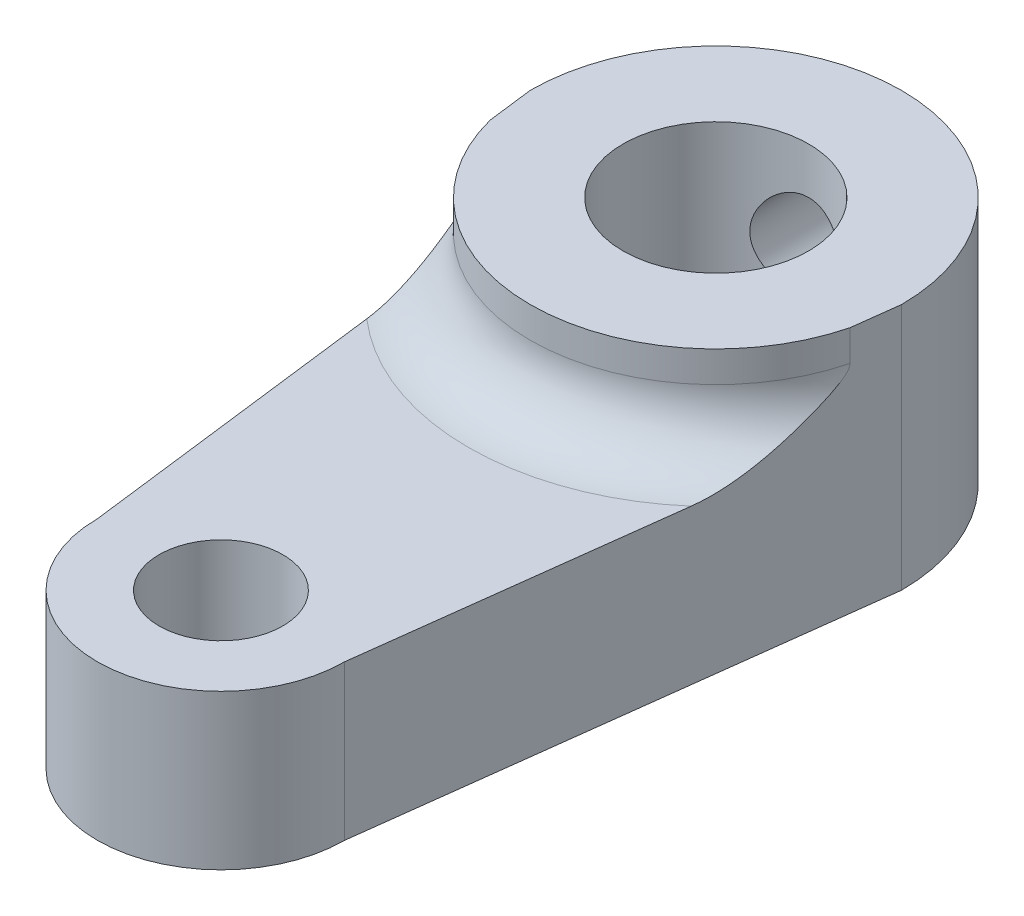
ISO-10303-21;
HEADER;
FILE_DESCRIPTION(('STEP AP214'),'2;1');
FILE_NAME('part.step','',(''),(''),'','','');
FILE_SCHEMA(('AUTOMOTIVE_DESIGN { 1 0 10303 214 1 1 1 1 }'));
ENDSEC;
DATA;
#1=APPLICATION_CONTEXT('core data for automotive mechanical design processes');
#2=APPLICATION_PROTOCOL_DEFINITION('international standard','automotive_design',2000,#1);
#3=PRODUCT_CONTEXT('',#1,'mechanical');
#4=PRODUCT('Part','Part','',(#3));
#5=PRODUCT_RELATED_PRODUCT_CATEGORY('part','',(#4));
#6=PRODUCT_DEFINITION_FORMATION('','',#4);
#7=PRODUCT_DEFINITION_CONTEXT('part definition',#1,'design');
#8=PRODUCT_DEFINITION('design','',#6,#7);
#9=PRODUCT_DEFINITION_SHAPE('','',#8);
#10=(LENGTH_UNIT() NAMED_UNIT(*) SI_UNIT(.MILLI.,.METRE.));
#11=(NAMED_UNIT(*) PLANE_ANGLE_UNIT() SI_UNIT($,.RADIAN.));
#12=(NAMED_UNIT(*) SI_UNIT($,.STERADIAN.) SOLID_ANGLE_UNIT());
#13=UNCERTAINTY_MEASURE_WITH_UNIT(LENGTH_MEASURE(1.E-05),#10,'distance_accuracy_value','');
#14=(GEOMETRIC_REPRESENTATION_CONTEXT(3) GLOBAL_UNCERTAINTY_ASSIGNED_CONTEXT((#13)) GLOBAL_UNIT_ASSIGNED_CONTEXT((#10,
#11,#12)) REPRESENTATION_CONTEXT('',''));
#15=CARTESIAN_POINT('',(0.,0.,0.));
#16=DIRECTION('',(0.,0.,1.));
#17=DIRECTION('',(1.,0.,0.));
#18=AXIS2_PLACEMENT_3D('',#15,#16,#17);
#19=CARTESIAN_POINT('',(5.90769230769231,8.,0.738461538461538));
#20=DIRECTION('',(0.992277876713668,0.,0.124034734589208));
#21=DIRECTION('',(0.124034734589208,0.,-0.992277876713668));
#22=AXIS2_PLACEMENT_3D('',#19,#20,#21);
#23=PLANE('',#22);
#24=DIRECTION('',(-0.124034734589208,0.,0.992277876713668));
#25=VECTOR('',#24,1.);
#26=CARTESIAN_POINT('',(5.90769230769231,0.,0.738461538461538));
#27=LINE('',#26,#25);
#28=CARTESIAN_POINT('',(6.,0.,0.));
#29=VERTEX_POINT('',#28);
#30=CARTESIAN_POINT('',(4.,0.,16.));
#31=VERTEX_POINT('',#30);
#32=EDGE_CURVE('E192',#29,#31,#27,.T.);
#33=ORIENTED_EDGE('',*,*,#32,.F.);
#34=DIRECTION('',(0.,-1.,0.));
#35=VECTOR('',#34,1.);
#36=CARTESIAN_POINT('',(6.,8.,0.));
#37=LINE('',#36,#35);
#38=CARTESIAN_POINT('',(6.,8.,0.));
#39=VERTEX_POINT('',#38);
#40=EDGE_CURVE('E222',#39,#29,#37,.T.);
#41=ORIENTED_EDGE('',*,*,#40,.F.);
#42=DIRECTION('',(-0.124034734589208,0.,0.992277876713668));
#43=VECTOR('',#42,1.);
#44=CARTESIAN_POINT('',(5.90769230769231,8.,0.738461538461538));
#45=LINE('',#44,#43);
#46=CARTESIAN_POINT('',(5.81538461538461,8.,1.47692307692309));
#47=VERTEX_POINT('',#46);
#48=EDGE_CURVE('E200',#39,#47,#45,.T.);
#49=ORIENTED_EDGE('',*,*,#48,.T.);
#50=DIRECTION('',(0.,-1.,0.));
#51=VECTOR('',#50,1.);
#52=CARTESIAN_POINT('',(5.81538461538461,8.,1.47692307692309));
#53=LINE('',#52,#51);
#54=CARTESIAN_POINT('',(5.81538461538461,7.,1.47692307692309));
#55=VERTEX_POINT('',#54);
#56=EDGE_CURVE('E215',#47,#55,#53,.T.);
#57=ORIENTED_EDGE('',*,*,#56,.T.);
#58=CARTESIAN_POINT('',(5.81538461538461,7.,1.47692307692309));
#59=CARTESIAN_POINT('',(5.81539476640519,6.98206835129727,1.47684186875847));
#60=CARTESIAN_POINT('',(5.81514366955309,6.96428540709011,1.47885064357526));
#61=CARTESIAN_POINT('',(5.81422921444883,6.92983220472927,1.48616628440938));
#62=CARTESIAN_POINT('',(5.81357557943099,6.91314568778468,1.49139536455203));
#63=CARTESIAN_POINT('',(5.81162595293372,6.87420948872529,1.50699237653024));
#64=CARTESIAN_POINT('',(5.81017650306979,6.85248149719556,1.51858797544166));
#65=CARTESIAN_POINT('',(5.80689217108803,6.81076560975714,1.54486263129576));
#66=CARTESIAN_POINT('',(5.80505296806003,6.79080110981863,1.55957625551977));
#67=CARTESIAN_POINT('',(5.7991545539981,6.73272152069167,1.60676356801519));
#68=CARTESIAN_POINT('',(5.7947497941713,6.69694269160291,1.64200164662958));
#69=CARTESIAN_POINT('',(5.78554512520158,6.62879824358649,1.71563899838738));
#70=CARTESIAN_POINT('',(5.78074363117118,6.59644762198184,1.75405095063054));
#71=CARTESIAN_POINT('',(5.77088827444036,6.53373910686026,1.83289380447712));
#72=CARTESIAN_POINT('',(5.76583285435553,6.5033970939871,1.87333716515574));
#73=CARTESIAN_POINT('',(5.75559700824011,6.44433146970121,1.9552239340791));
#74=CARTESIAN_POINT('',(5.75041686682505,6.41560459540483,1.99666506539963));
#75=CARTESIAN_POINT('',(5.73484220295515,6.33170775155011,2.12126237635882));
#76=CARTESIAN_POINT('',(5.72431018815304,6.27819828583969,2.20551849477567));
#77=CARTESIAN_POINT('',(5.70301501839821,6.17423919749159,2.37587985281428));
#78=CARTESIAN_POINT('',(5.69225178892419,6.12379058203655,2.46198568860647));
#79=CARTESIAN_POINT('',(5.67052305321617,6.02544013060181,2.63581557427062));
#80=CARTESIAN_POINT('',(5.65955722874636,5.97754285995481,2.72354217002912));
#81=CARTESIAN_POINT('',(5.63746380566257,5.88428321543631,2.9002895546994));
#82=CARTESIAN_POINT('',(5.62633623164352,5.83892046115491,2.98931014685185));
#83=CARTESIAN_POINT('',(5.59291980054501,5.70748650409316,3.25664159563991));
#84=CARTESIAN_POINT('',(5.57040018808343,5.62517964425519,3.43679849533257));
#85=CARTESIAN_POINT('',(5.52477249391602,5.47230141460988,3.80182004867185));
#86=CARTESIAN_POINT('',(5.5016649031749,5.40172060179224,3.98668077460082));
#87=CARTESIAN_POINT('',(5.45956735311022,5.28746693256519,4.32346117511823));
#88=CARTESIAN_POINT('',(5.4406847693354,5.24123752816757,4.47452184531682));
#89=CARTESIAN_POINT('',(5.40257489846932,5.15935265505968,4.77940081224546));
#90=CARTESIAN_POINT('',(5.38334776102864,5.12369270834051,4.9332179117709));
#91=CARTESIAN_POINT('',(5.3443701465846,5.06438903547159,5.24503882732318));
#92=CARTESIAN_POINT('',(5.32461618800929,5.04088917160202,5.40307049592571));
#93=CARTESIAN_POINT('',(5.29482842693842,5.01674380568157,5.64137258449261));
#94=CARTESIAN_POINT('',(5.28486188080753,5.01054539863813,5.72110495353973));
#95=CARTESIAN_POINT('',(5.26489886909373,5.00217436340395,5.88080904725014));
#96=CARTESIAN_POINT('',(5.25490239259256,5.00000344779633,5.96078085925952));
#97=CARTESIAN_POINT('',(5.24490279296806,5.,6.04077765625551));
#98=B_SPLINE_CURVE_WITH_KNOTS('',3,(#58,#59,#60,#61,#62,#63,#64,#65,#66,#67,#68,#69,#70,#71,#72,
#73,#74,#75,#76,#77,#78,#79,#80,#81,#82,#83,#84,#85,#86,#87,#88,#89,#90,#91,#92,#93,#94,#95,#96,
#97),.UNSPECIFIED.,.F.,.F.,(4,2,2,2,2,2,2,2,2,2,2,2,2,2,2,2,2,2,2,4),(0.,0.0534457094729938,
0.105648500704282,0.179238899339844,0.253692350821764,0.404347373934459,0.555636393518103,
0.708005822765175,0.860055475605026,1.16103965292558,1.46212233884608,1.76372682895045,
2.06528592843856,2.66294892892358,3.26012827234663,3.73710737769687,4.21388410938346,
4.69617941237984,4.93786444212931,5.17965221844567),.UNSPECIFIED.);
#99=CARTESIAN_POINT('',(5.24490279296806,5.,6.04077765625551));
#100=VERTEX_POINT('',#99);
#101=EDGE_CURVE('E119',#55,#100,#98,.T.);
#102=ORIENTED_EDGE('',*,*,#101,.T.);
#103=DIRECTION('',(-0.124034734589208,0.,0.992277876713668));
#104=VECTOR('',#103,1.);
#105=CARTESIAN_POINT('',(5.90769230769231,5.,0.738461538461538));
#106=LINE('',#105,#104);
#107=CARTESIAN_POINT('',(4.,5.,16.));
#108=VERTEX_POINT('',#107);
#109=EDGE_CURVE('E183',#100,#108,#106,.T.);
#110=ORIENTED_EDGE('',*,*,#109,.T.);
#111=DIRECTION('',(0.,-1.,0.));
#112=VECTOR('',#111,1.);
#113=CARTESIAN_POINT('',(4.,5.,16.));
#114=LINE('',#113,#112);
#115=EDGE_CURVE('E182',#108,#31,#114,.T.);
#116=ORIENTED_EDGE('',*,*,#115,.T.);
#117=EDGE_LOOP('',(#33,#41,#49,#57,#102,#110,#116));
#118=FACE_BOUND('',#117,.T.);
#119=ADVANCED_FACE('F105',(#118),#23,.T.);
#120=CARTESIAN_POINT('',(0.,8.,0.));
#121=DIRECTION('',(0.,-1.,0.));
#122=DIRECTION('',(0.,0.,-1.));
#123=AXIS2_PLACEMENT_3D('',#120,#121,#122);
#124=CYLINDRICAL_SURFACE('',#123,6.);
#125=CARTESIAN_POINT('',(-1.5,5.,-5.80947501931113));
#126=CARTESIAN_POINT('',(-1.49999764715506,4.91716954944523,-5.80947660051185));
#127=CARTESIAN_POINT('',(-1.49311574729838,4.8343130607932,-5.81126583608348));
#128=CARTESIAN_POINT('',(-1.46581387527848,4.67097945309558,-5.81821117195949));
#129=CARTESIAN_POINT('',(-1.44538602404532,4.590503747319,-5.82336923173088));
#130=CARTESIAN_POINT('',(-1.39169471977917,4.43431787708778,-5.8364323475758));
#131=CARTESIAN_POINT('',(-1.35844783671268,4.3586017067686,-5.84433385614245));
#132=CARTESIAN_POINT('',(-1.28011268475684,4.21381348847605,-5.86198915217285));
#133=CARTESIAN_POINT('',(-1.23502391313641,4.14474172275187,-5.87174301827101));
#134=CARTESIAN_POINT('',(-1.13322505638712,4.01368301284268,-5.89224429813367));
#135=CARTESIAN_POINT('',(-1.07630213262243,3.95186383978997,-5.90300758573818));
#136=CARTESIAN_POINT('',(-0.952909238460398,3.8385431633838,-5.92417725309179));
#137=CARTESIAN_POINT('',(-0.886438376508183,3.78704262462695,-5.93458359939834));
#138=CARTESIAN_POINT('',(-0.744687120647372,3.69513471942124,-5.95404249312349));
#139=CARTESIAN_POINT('',(-0.669296745717072,3.65489216710312,-5.96307412440355));
#140=CARTESIAN_POINT('',(-0.512557910575657,3.58771421350815,-5.97858487155591));
#141=CARTESIAN_POINT('',(-0.431210331475164,3.56077684885069,-5.98506436400607));
#142=CARTESIAN_POINT('',(-0.266615255252497,3.52151129925285,-5.99462855308908));
#143=CARTESIAN_POINT('',(-0.183439631729385,3.50889821340405,-5.99777936306589));
#144=CARTESIAN_POINT('',(-0.0160972915576619,3.49774497243467,-6.00056156464379));
#145=CARTESIAN_POINT('',(0.0680692767228407,3.49920273667424,-6.00019347658022));
#146=CARTESIAN_POINT('',(0.23302837075858,3.51594491015009,-5.99602856972121));
#147=CARTESIAN_POINT('',(0.3138543234016,3.53092179503232,-5.99230801404524));
#148=CARTESIAN_POINT('',(0.471807371120528,3.5737827620291,-5.98194501914912));
#149=CARTESIAN_POINT('',(0.548934269055656,3.60166753122645,-5.97530242439065));
#150=CARTESIAN_POINT('',(0.698110055252709,3.66980154241224,-5.95972505820537));
#151=CARTESIAN_POINT('',(0.770106764649755,3.71016022679705,-5.95077011817032));
#152=CARTESIAN_POINT('',(0.906413433510732,3.80201340746976,-5.9315394228579));
#153=CARTESIAN_POINT('',(0.970722052628257,3.85350984113637,-5.92126343791494));
#154=CARTESIAN_POINT('',(1.09166105262743,3.96782524518943,-5.90018228261712));
#155=CARTESIAN_POINT('',(1.1480365186128,4.03091293540867,-5.88937031715551));
#156=CARTESIAN_POINT('',(1.24946456394453,4.16575998412415,-5.86869026110024));
#157=CARTESIAN_POINT('',(1.29451661406902,4.2375197476946,-5.85882221463582));
#158=CARTESIAN_POINT('',(1.3721821935339,4.38817402048938,-5.84112298098989));
#159=CARTESIAN_POINT('',(1.40473435045573,4.46710143818792,-5.83330190235433));
#160=CARTESIAN_POINT('',(1.45602843095451,4.62955128084587,-5.82071184083974));
#161=CARTESIAN_POINT('',(1.47477330982936,4.71307271838988,-5.81594220486131));
#162=CARTESIAN_POINT('',(1.4974977831991,4.87997570091387,-5.81013213623485));
#163=CARTESIAN_POINT('',(1.50185428435178,4.96330267599778,-5.80899653456189));
#164=CARTESIAN_POINT('',(1.49671019430933,5.1294931619469,-5.81032406088624));
#165=CARTESIAN_POINT('',(1.48721087870928,5.21235671477074,-5.8127868576076));
#166=CARTESIAN_POINT('',(1.4549552783626,5.37386855897282,-5.82094249172736));
#167=CARTESIAN_POINT('',(1.43241844096905,5.45256363594251,-5.82658182140625));
#168=CARTESIAN_POINT('',(1.37497084900237,5.60505887471101,-5.84040430962577));
#169=CARTESIAN_POINT('',(1.34005862862753,5.6788584554332,-5.84858776949168));
#170=CARTESIAN_POINT('',(1.25806240076193,5.82106476672041,-5.86677682255958));
#171=CARTESIAN_POINT('',(1.21075305230138,5.88933730402586,-5.87681501163985));
#172=CARTESIAN_POINT('',(1.10559043940168,6.01711301768081,-5.8975024984303));
#173=CARTESIAN_POINT('',(1.04773544220816,6.07661474999004,-5.90815189637082));
#174=CARTESIAN_POINT('',(0.921394081477087,6.18668662554257,-5.92918441818964));
#175=CARTESIAN_POINT('',(0.852677928797387,6.23699603752929,-5.93955421237102));
#176=CARTESIAN_POINT('',(0.707554024042012,6.32536152017074,-5.95858329968241));
#177=CARTESIAN_POINT('',(0.631146673436386,6.36341822996492,-5.96724268202376));
#178=CARTESIAN_POINT('',(0.473337302596634,6.42586762071676,-5.98182069442989));
#179=CARTESIAN_POINT('',(0.391976071541821,6.45035857062744,-5.98775898013446));
#180=CARTESIAN_POINT('',(0.226124640478211,6.48527620076505,-5.99631176037473));
#181=CARTESIAN_POINT('',(0.141635047561865,6.49570559524343,-5.99892689636045));
#182=CARTESIAN_POINT('',(-0.0256252896649893,6.5020513843633,-6.00051254113217));
#183=CARTESIAN_POINT('',(-0.108380740449049,6.49835256364308,-5.99957968320012));
#184=CARTESIAN_POINT('',(-0.272051244622109,6.4774282590585,-5.99438844686135));
#185=CARTESIAN_POINT('',(-0.352966352671329,6.46020317748035,-5.99013016735643));
#186=CARTESIAN_POINT('',(-0.510256553467224,6.41292167034361,-5.97878149280944));
#187=CARTESIAN_POINT('',(-0.586653741871528,6.38293482002806,-5.97170646753999));
#188=CARTESIAN_POINT('',(-0.733375579562202,6.31104413147101,-5.95546933370076));
#189=CARTESIAN_POINT('',(-0.803699461897576,6.26913879099565,-5.94630696206604));
#190=CARTESIAN_POINT('',(-0.938102892635848,6.17342714900439,-5.92660874521999));
#191=CARTESIAN_POINT('',(-1.00199248245087,6.11935978563893,-5.91604525418417));
#192=CARTESIAN_POINT('',(-1.11992253040688,6.0013657220393,-5.89485973579863));
#193=CARTESIAN_POINT('',(-1.17396048760228,5.93743652585314,-5.88423769428834));
#194=CARTESIAN_POINT('',(-1.27164303971884,5.800097878698,-5.86391213790822));
#195=CARTESIAN_POINT('',(-1.31507492916982,5.72653381488106,-5.85422945594827));
#196=CARTESIAN_POINT('',(-1.3888903449235,5.57291676511595,-5.83715933325924));
#197=CARTESIAN_POINT('',(-1.41928336463958,5.49286855083989,-5.82977022370054));
#198=CARTESIAN_POINT('',(-1.46163379284816,5.34413448225992,-5.81927863109675));
#199=CARTESIAN_POINT('',(-1.47598975589307,5.27616025342421,-5.8156299450082));
#200=CARTESIAN_POINT('',(-1.4951734388599,5.13879669650006,-5.81072757878358));
#201=CARTESIAN_POINT('',(-1.50000197155828,5.06940748963241,-5.80947369434945));
#202=CARTESIAN_POINT('',(-1.5,5.,-5.80947501931113));
#203=B_SPLINE_CURVE_WITH_KNOTS('',3,(#125,#126,#127,#128,#129,#130,#131,#132,#133,#134,#135,
#136,#137,#138,#139,#140,#141,#142,#143,#144,#145,#146,#147,#148,#149,#150,#151,#152,#153,#154,
#155,#156,#157,#158,#159,#160,#161,#162,#163,#164,#165,#166,#167,#168,#169,#170,#171,#172,#173,
#174,#175,#176,#177,#178,#179,#180,#181,#182,#183,#184,#185,#186,#187,#188,#189,#190,#191,#192,
#193,#194,#195,#196,#197,#198,#199,#200,#201,#202),.UNSPECIFIED.,.T.,.F.,(4,2,2,2,2,2,2,2,2,2,2,
2,2,2,2,2,2,2,2,2,2,2,2,2,2,2,2,2,2,2,2,2,2,2,2,2,2,2,4),(0.,0.248236465041681,
0.496617444857199,0.744678436299611,0.99274996053287,1.24574372515785,1.4987611288792,
1.75530897838752,2.01181895908255,2.26313250597208,2.51440889199612,2.76010957613368,
3.00582334034871,3.25375724552666,3.50173431281348,3.75642279943147,4.01112318719881,
4.26705859205041,4.52293920077728,4.7720614485703,5.02116076310281,5.26618443005523,
5.5112371285285,5.76109707515494,6.01099811331026,6.26715198579191,6.52329249431731,
6.77755243684157,7.03176329345422,7.27910067676473,7.52643070426188,7.77242925935826,
8.01845883442842,8.27038257949241,8.52237018939304,8.77905886370805,9.03556032819971,
9.24358696306397,9.45159585059711),.UNSPECIFIED.);
#204=CARTESIAN_POINT('',(-1.5,5.,-5.80947501931113));
#205=VERTEX_POINT('',#204);
#206=EDGE_CURVE('E275',#205,#205,#203,.T.);
#207=ORIENTED_EDGE('',*,*,#206,.T.);
#208=EDGE_LOOP('',(#207));
#209=FACE_BOUND('',#208,.T.);
#210=CARTESIAN_POINT('',(0.,0.,0.));
#211=DIRECTION('',(0.,1.,0.));
#212=DIRECTION('',(0.,0.,1.));
#213=AXIS2_PLACEMENT_3D('',#210,#211,#212);
#214=CIRCLE('',#213,6.);
#215=CARTESIAN_POINT('',(-6.,0.,0.));
#216=VERTEX_POINT('',#215);
#217=EDGE_CURVE('E211',#29,#216,#214,.T.);
#218=ORIENTED_EDGE('',*,*,#217,.T.);
#219=DIRECTION('',(0.,-1.,0.));
#220=VECTOR('',#219,1.);
#221=CARTESIAN_POINT('',(-6.,8.,0.));
#222=LINE('',#221,#220);
#223=CARTESIAN_POINT('',(-6.,8.,0.));
#224=VERTEX_POINT('',#223);
#225=EDGE_CURVE('E220',#224,#216,#222,.T.);
#226=ORIENTED_EDGE('',*,*,#225,.F.);
#227=CARTESIAN_POINT('',(0.,8.,0.));
#228=DIRECTION('',(0.,1.,0.));
#229=DIRECTION('',(0.,0.,1.));
#230=AXIS2_PLACEMENT_3D('',#227,#228,#229);
#231=CIRCLE('',#230,6.);
#232=EDGE_CURVE('E203',#39,#224,#231,.T.);
#233=ORIENTED_EDGE('',*,*,#232,.F.);
#234=ORIENTED_EDGE('',*,*,#40,.T.);
#235=EDGE_LOOP('',(#218,#226,#233,#234));
#236=FACE_BOUND('',#235,.T.);
#237=ADVANCED_FACE('F240',(#209,#236),#124,.T.);
#238=CARTESIAN_POINT('',(-5.90769230769231,8.,0.738461538461538));
#239=DIRECTION('',(0.992277876713668,0.,-0.124034734589208));
#240=DIRECTION('',(-0.124034734589208,0.,-0.992277876713668));
#241=AXIS2_PLACEMENT_3D('',#238,#239,#240);
#242=PLANE('',#241);
#243=DIRECTION('',(0.124034734589208,0.,0.992277876713668));
#244=VECTOR('',#243,1.);
#245=CARTESIAN_POINT('',(-5.90769230769231,0.,0.738461538461538));
#246=LINE('',#245,#244);
#247=CARTESIAN_POINT('',(-4.,0.,16.));
#248=VERTEX_POINT('',#247);
#249=EDGE_CURVE('E187',#216,#248,#246,.T.);
#250=ORIENTED_EDGE('',*,*,#249,.T.);
#251=DIRECTION('',(0.,-1.,0.));
#252=VECTOR('',#251,1.);
#253=CARTESIAN_POINT('',(-4.,5.,16.));
#254=LINE('',#253,#252);
#255=CARTESIAN_POINT('',(-4.,5.,16.));
#256=VERTEX_POINT('',#255);
#257=EDGE_CURVE('E180',#256,#248,#254,.T.);
#258=ORIENTED_EDGE('',*,*,#257,.F.);
#259=DIRECTION('',(0.124034734589208,0.,0.992277876713668));
#260=VECTOR('',#259,1.);
#261=CARTESIAN_POINT('',(-5.90769230769231,5.,0.738461538461538));
#262=LINE('',#261,#260);
#263=CARTESIAN_POINT('',(-5.24490279296806,5.,6.04077765625551));
#264=VERTEX_POINT('',#263);
#265=EDGE_CURVE('E166',#264,#256,#262,.T.);
#266=ORIENTED_EDGE('',*,*,#265,.F.);
#267=CARTESIAN_POINT('',(-5.24490279296806,5.,6.04077765625551));
#268=CARTESIAN_POINT('',(-5.26312643125407,5.00003666719876,5.89498854996742));
#269=CARTESIAN_POINT('',(-5.2813299535524,5.00721748276434,5.74936037158076));
#270=CARTESIAN_POINT('',(-5.31756349072174,5.03411812202512,5.45949207422607));
#271=CARTESIAN_POINT('',(-5.33559376063232,5.05381515322618,5.31524991494143));
#272=CARTESIAN_POINT('',(-5.37129482468174,5.10384401837015,5.02964140254603));
#273=CARTESIAN_POINT('',(-5.38896721531084,5.13410395623439,4.88826227751325));
#274=CARTESIAN_POINT('',(-5.42403332064785,5.20386765252683,4.60773343481722));
#275=CARTESIAN_POINT('',(-5.44142692191116,5.24337507676749,4.46858462471069));
#276=CARTESIAN_POINT('',(-5.4810054237753,5.3432510217201,4.15195660979755));
#277=CARTESIAN_POINT('',(-5.50308457126954,5.40633293535076,3.97532342984369));
#278=CARTESIAN_POINT('',(-5.54671320659746,5.54367923274424,3.62629434722035));
#279=CARTESIAN_POINT('',(-5.56826230968892,5.61795147588235,3.45390152248864));
#280=CARTESIAN_POINT('',(-5.60459976784471,5.75293656937012,3.16320185724233));
#281=CARTESIAN_POINT('',(-5.61952510858665,5.81127708891284,3.04379913130677));
#282=CARTESIAN_POINT('',(-5.64909385600154,5.9324203459862,2.80724915198765));
#283=CARTESIAN_POINT('',(-5.66373728862396,5.99522267029002,2.69010169100827));
#284=CARTESIAN_POINT('',(-5.68796904218565,6.10415455562156,2.49624766251483));
#285=CARTESIAN_POINT('',(-5.69764493099785,6.14902263064008,2.41884055201718));
#286=CARTESIAN_POINT('',(-5.71681794892631,6.24111940695815,2.26545640858952));
#287=CARTESIAN_POINT('',(-5.72631515955559,6.28834699404336,2.18947872355532));
#288=CARTESIAN_POINT('',(-5.74184163615795,6.36919475866766,2.06526691073642));
#289=CARTESIAN_POINT('',(-5.74794243186688,6.40192206577084,2.01646054506495));
#290=CARTESIAN_POINT('',(-5.75999809127789,6.46924400295127,1.92001526977687));
#291=CARTESIAN_POINT('',(-5.7659527569677,6.50384098308618,1.87237794425836));
#292=CARTESIAN_POINT('',(-5.77700151689373,6.57203994747654,1.78398786485013));
#293=CARTESIAN_POINT('',(-5.78212097076342,6.60537560389929,1.74303223389261));
#294=CARTESIAN_POINT('',(-5.79198990152579,6.67548838589802,1.66408078779371));
#295=CARTESIAN_POINT('',(-5.79674021484076,6.71225728933227,1.62607828127395));
#296=CARTESIAN_POINT('',(-5.80286577290341,6.76883231980867,1.57707381677274));
#297=CARTESIAN_POINT('',(-5.80459824373197,6.78608005134936,1.56321405014424));
#298=CARTESIAN_POINT('',(-5.80782269584906,6.82201840915203,1.5374184332075));
#299=CARTESIAN_POINT('',(-5.80931478527885,6.84070838095967,1.52548171776919));
#300=CARTESIAN_POINT('',(-5.81159891594161,6.87497867747791,1.50720867246712));
#301=CARTESIAN_POINT('',(-5.81247289682051,6.89019717688797,1.50021682543591));
#302=CARTESIAN_POINT('',(-5.81391417157753,6.92152861095998,1.48868662737979));
#303=CARTESIAN_POINT('',(-5.81448270417408,6.93763763624524,1.48413836660739));
#304=CARTESIAN_POINT('',(-5.81503071691365,6.96159214755093,1.47975426469077));
#305=CARTESIAN_POINT('',(-5.81516254495619,6.96921917574478,1.47869964035049));
#306=CARTESIAN_POINT('',(-5.81533984659839,6.98456220309282,1.47728122721288));
#307=CARTESIAN_POINT('',(-5.81538504482327,6.99227840778438,1.4769196414138));
#308=CARTESIAN_POINT('',(-5.81538461538461,7.,1.47692307692309));
#309=B_SPLINE_CURVE_WITH_KNOTS('',3,(#267,#268,#269,#270,#271,#272,#273,#274,#275,#276,#277,
#278,#279,#280,#281,#282,#283,#284,#285,#286,#287,#288,#289,#290,#291,#292,#293,#294,#295,#296,
#297,#298,#299,#300,#301,#302,#303,#304,#305,#306,#307,#308),.UNSPECIFIED.,.F.,.F.,(4,2,2,2,2,2,
2,2,2,2,2,2,2,2,2,2,2,2,2,2,4),(0.,0.440365794165008,0.879931955049919,1.31656275509205,
1.75336693473425,2.31946673367812,2.88596599463609,3.28706789905176,3.68813270400984,
3.95808072117705,4.22790244603649,4.40511886635727,4.58256346573586,4.74168004718302,
4.90042488980729,4.96692652863706,5.03339816608035,5.08356423332926,5.13352529074198,
5.15659859168335,5.17974511609008),.UNSPECIFIED.);
#310=CARTESIAN_POINT('',(-5.81538461538461,7.,1.47692307692309));
#311=VERTEX_POINT('',#310);
#312=EDGE_CURVE('E59',#264,#311,#309,.T.);
#313=ORIENTED_EDGE('',*,*,#312,.T.);
#314=DIRECTION('',(0.,-1.,0.));
#315=VECTOR('',#314,1.);
#316=CARTESIAN_POINT('',(-5.81538461538461,8.,1.47692307692309));
#317=LINE('',#316,#315);
#318=CARTESIAN_POINT('',(-5.81538461538461,8.,1.47692307692309));
#319=VERTEX_POINT('',#318);
#320=EDGE_CURVE('E217',#319,#311,#317,.T.);
#321=ORIENTED_EDGE('',*,*,#320,.F.);
#322=DIRECTION('',(0.124034734589208,0.,0.992277876713668));
#323=VECTOR('',#322,1.);
#324=CARTESIAN_POINT('',(-5.90769230769231,8.,0.738461538461538));
#325=LINE('',#324,#323);
#326=EDGE_CURVE('E206',#224,#319,#325,.T.);
#327=ORIENTED_EDGE('',*,*,#326,.F.);
#328=ORIENTED_EDGE('',*,*,#225,.T.);
#329=EDGE_LOOP('',(#250,#258,#266,#313,#321,#327,#328));
#330=FACE_BOUND('',#329,.T.);
#331=ADVANCED_FACE('F185',(#330),#242,.F.);
#332=CARTESIAN_POINT('',(0.,8.,0.));
#333=DIRECTION('',(0.,-1.,0.));
#334=DIRECTION('',(0.,0.,-1.));
#335=AXIS2_PLACEMENT_3D('',#332,#333,#334);
#336=CYLINDRICAL_SURFACE('',#335,3.);
#337=CARTESIAN_POINT('',(0.,6.5,-3.));
#338=CARTESIAN_POINT('',(-0.0788579444268501,6.49999504652421,-2.99999570107562));
#339=CARTESIAN_POINT('',(-0.157809899546343,6.49374489031841,-2.99685736529635));
#340=CARTESIAN_POINT('',(-0.313380352903344,6.46902067948769,-2.98461234055736));
#341=CARTESIAN_POINT('',(-0.389994130070444,6.45052341050327,-2.97549431743379));
#342=CARTESIAN_POINT('',(-0.538400317320673,6.40220928707505,-2.95224419105063));
#343=CARTESIAN_POINT('',(-0.610210204408719,6.37243642362805,-2.93813158766306));
#344=CARTESIAN_POINT('',(-0.747708925209897,6.30264406795252,-2.90618664773642));
#345=CARTESIAN_POINT('',(-0.813398240985088,6.2626253836267,-2.88835460450288));
#346=CARTESIAN_POINT('',(-0.941261726642863,6.17072412577207,-2.84934387387093));
#347=CARTESIAN_POINT('',(-1.00298281668316,6.11827028114054,-2.82802798691306));
#348=CARTESIAN_POINT('',(-1.11716916730047,6.00421778112944,-2.78489955370115));
#349=CARTESIAN_POINT('',(-1.16962737466015,5.94261222234134,-2.76308664313552));
#350=CARTESIAN_POINT('',(-1.26787800067542,5.80627497571493,-2.71948426796021));
#351=CARTESIAN_POINT('',(-1.31283800332745,5.73089585248113,-2.69782780455198));
#352=CARTESIAN_POINT('',(-1.38925234033604,5.57244899602068,-2.65928968158481));
#353=CARTESIAN_POINT('',(-1.4207163224495,5.48938680691588,-2.64240461410485));
#354=CARTESIAN_POINT('',(-1.46719866328288,5.32300234186712,-2.61686800556713));
#355=CARTESIAN_POINT('',(-1.48308878562066,5.23999332189891,-2.6077840737557));
#356=CARTESIAN_POINT('',(-1.50064048996327,5.07203174333078,-2.59772834922792));
#357=CARTESIAN_POINT('',(-1.50231613255961,4.98708118869327,-2.59674854014932));
#358=CARTESIAN_POINT('',(-1.49203093075844,4.82857096352695,-2.60266395385873));
#359=CARTESIAN_POINT('',(-1.48167683930523,4.75486395316542,-2.6086314549302));
#360=CARTESIAN_POINT('',(-1.4504097735854,4.61041713594044,-2.62614343100776));
#361=CARTESIAN_POINT('',(-1.42949343584648,4.53967828204203,-2.63768968247665));
#362=CARTESIAN_POINT('',(-1.377314670579,4.40115630115151,-2.66531214619112));
#363=CARTESIAN_POINT('',(-1.34582260067399,4.33348040182132,-2.68148760995998));
#364=CARTESIAN_POINT('',(-1.273562531502,4.20404856111499,-2.71655106422106));
#365=CARTESIAN_POINT('',(-1.2327903657187,4.14229529659987,-2.73544027170286));
#366=CARTESIAN_POINT('',(-1.13709908236918,4.01821812088516,-2.77669736854929));
#367=CARTESIAN_POINT('',(-1.08104168755392,3.95681468963576,-2.79920265355119));
#368=CARTESIAN_POINT('',(-0.959333368112058,3.84389687211365,-2.84321434950611));
#369=CARTESIAN_POINT('',(-0.893677884861426,3.79238721194918,-2.86472027938201));
#370=CARTESIAN_POINT('',(-0.750774758747771,3.69847150845541,-2.90552980924446));
#371=CARTESIAN_POINT('',(-0.673130387399112,3.65659929133139,-2.92468476243011));
#372=CARTESIAN_POINT('',(-0.510699323233194,3.58685445643549,-2.95736821681863));
#373=CARTESIAN_POINT('',(-0.425918364397913,3.55897072247725,-2.9709011841533));
#374=CARTESIAN_POINT('',(-0.259149737491053,3.52028689442499,-2.98986500612153));
#375=CARTESIAN_POINT('',(-0.177512295822489,3.50826314637983,-2.99587407451965));
#376=CARTESIAN_POINT('',(-0.0131693999240273,3.49780290329827,-3.00109520188655));
#377=CARTESIAN_POINT('',(0.0695355298048632,3.4993599715408,-3.00031048081978));
#378=CARTESIAN_POINT('',(0.22684945797898,3.51531003262812,-2.99236788380152));
#379=CARTESIAN_POINT('',(0.301589112074895,3.52869879909499,-2.98570868532253));
#380=CARTESIAN_POINT('',(0.447610338452911,3.56635710784268,-2.9673325697226));
#381=CARTESIAN_POINT('',(0.51889152853663,3.59062784968024,-2.95561509501618));
#382=CARTESIAN_POINT('',(0.658332912674359,3.64999769964955,-2.92776377120382));
#383=CARTESIAN_POINT('',(0.726345595508705,3.68538657517443,-2.91151322654446));
#384=CARTESIAN_POINT('',(0.855692042548907,3.76566130346985,-2.87615961476126));
#385=CARTESIAN_POINT('',(0.917022944664887,3.8105512018931,-2.85705533350407));
#386=CARTESIAN_POINT('',(1.03765153393382,3.91364063799608,-2.81562332004297));
#387=CARTESIAN_POINT('',(1.09615811672854,3.97271430266772,-2.79316327265249));
#388=CARTESIAN_POINT('',(1.20278448167828,4.09988772691659,-2.7489358741323));
#389=CARTESIAN_POINT('',(1.25089707856781,4.16799367827188,-2.72716901100071));
#390=CARTESIAN_POINT('',(1.33756187171852,4.31546548125947,-2.68576788309734));
#391=CARTESIAN_POINT('',(1.37553824370037,4.39521689914172,-2.66628794383591));
#392=CARTESIAN_POINT('',(1.43712423890205,4.56126510136245,-2.63361108441202));
#393=CARTESIAN_POINT('',(1.46075237380052,4.64755328970034,-2.62040607332625));
#394=CARTESIAN_POINT('',(1.49079253120031,4.81536533432706,-2.60342251538703));
#395=CARTESIAN_POINT('',(1.49863949460818,4.89655138015286,-2.59886075197597));
#396=CARTESIAN_POINT('',(1.5010337315643,5.05917060074679,-2.59748031962405));
#397=CARTESIAN_POINT('',(1.49558676993486,5.14060365310679,-2.60065829439585));
#398=CARTESIAN_POINT('',(1.47288918838996,5.29322525230016,-2.61356793076615));
#399=CARTESIAN_POINT('',(1.45681247151455,5.36465070521711,-2.62264641723988));
#400=CARTESIAN_POINT('',(1.41476303733661,5.50371217913655,-2.64556524281479));
#401=CARTESIAN_POINT('',(1.38878713673988,5.57134697313805,-2.65940711354503));
#402=CARTESIAN_POINT('',(1.32572361795084,5.7059372764798,-2.69142795546804));
#403=CARTESIAN_POINT('',(1.28800670672355,5.77254185274354,-2.70983583593881));
#404=CARTESIAN_POINT('',(1.20322645745609,5.89891180427189,-2.74852997452291));
#405=CARTESIAN_POINT('',(1.15615825686234,5.95867359578167,-2.76881720693416));
#406=CARTESIAN_POINT('',(1.04730498999206,6.07721297353201,-2.81193484737138));
#407=CARTESIAN_POINT('',(0.98442663449589,6.13498865352544,-2.83477474959942));
#408=CARTESIAN_POINT('',(0.849232209349794,6.2393944751529,-2.87816628389896));
#409=CARTESIAN_POINT('',(0.776911084957794,6.28601860920486,-2.89871667939293));
#410=CARTESIAN_POINT('',(0.623897395174417,6.3668545440681,-2.93547014349806));
#411=CARTESIAN_POINT('',(0.543149255665094,6.4009762538547,-2.95164144740899));
#412=CARTESIAN_POINT('',(0.376113151707129,6.45471225163611,-2.9775201194848));
#413=CARTESIAN_POINT('',(0.289841699383649,6.47436777020857,-2.98724585044602));
#414=CARTESIAN_POINT('',(0.168902919736342,6.49084611662861,-2.99543192870217));
#415=CARTESIAN_POINT('',(0.135242819162347,6.49427396129951,-2.99714048010376));
#416=CARTESIAN_POINT('',(0.067727597707637,6.49885199827113,-2.99942545465223));
#417=CARTESIAN_POINT('',(0.0338724714699425,6.50000212770531,-3.00000184655071));
#418=CARTESIAN_POINT('',(0.,6.5,-3.));
#419=B_SPLINE_CURVE_WITH_KNOTS('',3,(#337,#338,#339,#340,#341,#342,#343,#344,#345,#346,#347,
#348,#349,#350,#351,#352,#353,#354,#355,#356,#357,#358,#359,#360,#361,#362,#363,#364,#365,#366,
#367,#368,#369,#370,#371,#372,#373,#374,#375,#376,#377,#378,#379,#380,#381,#382,#383,#384,#385,
#386,#387,#388,#389,#390,#391,#392,#393,#394,#395,#396,#397,#398,#399,#400,#401,#402,#403,#404,
#405,#406,#407,#408,#409,#410,#411,#412,#413,#414,#415,#416,#417,#418),.UNSPECIFIED.,.T.,.F.,(4,
2,2,2,2,2,2,2,2,2,2,2,2,2,2,2,2,2,2,2,2,2,2,2,2,2,2,2,2,2,2,2,2,2,2,2,2,2,2,2,4),(0.,
0.236436386130439,0.473322224563796,0.709293233238447,0.94524564087235,1.19547263807713,
1.44588935648105,1.71572589646129,1.98536921847421,2.23887018210344,2.4921203599353,
2.71508568613981,2.93812205888517,3.16635360252731,3.39468781890332,3.65197412000817,
3.90938301898029,4.1787453332166,4.44789325368419,4.69474935707018,4.94148846767213,
5.16910359759182,5.39674382446397,5.63089284041847,5.86514176122508,6.12239415966627,
6.37982382923147,6.64972023242588,6.91926767918175,7.16293961254569,7.40650589797017,
7.62686895373283,7.84730293182526,8.0825468517043,8.31791341715445,8.58187864135756,
8.84598575071868,9.11196020495289,9.37717362931723,9.47872920200874,9.58028757766598),.UNSPECIFIED.);
#420=CARTESIAN_POINT('',(0.,6.5,-3.));
#421=VERTEX_POINT('',#420);
#422=EDGE_CURVE('E110',#421,#421,#419,.T.);
#423=ORIENTED_EDGE('',*,*,#422,.F.);
#424=EDGE_LOOP('',(#423));
#425=FACE_BOUND('',#424,.T.);
#426=CARTESIAN_POINT('',(0.,8.,0.));
#427=DIRECTION('',(0.,1.,0.));
#428=DIRECTION('',(0.,0.,1.));
#429=AXIS2_PLACEMENT_3D('',#426,#427,#428);
#430=CIRCLE('',#429,3.);
#431=CARTESIAN_POINT('',(0.,8.,3.));
#432=VERTEX_POINT('',#431);
#433=EDGE_CURVE('E197',#432,#432,#430,.T.);
#434=ORIENTED_EDGE('',*,*,#433,.T.);
#435=EDGE_LOOP('',(#434));
#436=FACE_BOUND('',#435,.T.);
#437=CARTESIAN_POINT('',(0.,0.,0.));
#438=DIRECTION('',(0.,1.,0.));
#439=DIRECTION('',(0.,0.,1.));
#440=AXIS2_PLACEMENT_3D('',#437,#438,#439);
#441=CIRCLE('',#440,3.);
#442=CARTESIAN_POINT('',(0.,0.,3.));
#443=VERTEX_POINT('',#442);
#444=EDGE_CURVE('E189',#443,#443,#441,.T.);
#445=ORIENTED_EDGE('',*,*,#444,.F.);
#446=EDGE_LOOP('',(#445));
#447=FACE_BOUND('',#446,.T.);
#448=ADVANCED_FACE('F243',(#425,#436,#447),#336,.F.);
#449=ORIENTED_EDGE('',*,*,#320,.T.);
#450=CARTESIAN_POINT('',(0.,7.,0.));
#451=DIRECTION('',(0.,1.,0.));
#452=DIRECTION('',(0.,0.,1.));
#453=AXIS2_PLACEMENT_3D('',#450,#451,#452);
#454=CIRCLE('',#453,6.);
#455=EDGE_CURVE('E224',#311,#55,#454,.T.);
#456=ORIENTED_EDGE('',*,*,#455,.T.);
#457=ORIENTED_EDGE('',*,*,#56,.F.);
#458=EDGE_CURVE('E207',#319,#47,#231,.T.);
#459=ORIENTED_EDGE('',*,*,#458,.F.);
#460=EDGE_LOOP('',(#449,#456,#457,#459));
#461=FACE_BOUND('',#460,.T.);
#462=ADVANCED_FACE('F246',(#461),#124,.T.);
#463=CARTESIAN_POINT('',(0.,8.,0.));
#464=DIRECTION('',(0.,1.,0.));
#465=DIRECTION('',(0.,0.,1.));
#466=AXIS2_PLACEMENT_3D('',#463,#464,#465);
#467=PLANE('',#466);
#468=ORIENTED_EDGE('',*,*,#433,.F.);
#469=EDGE_LOOP('',(#468));
#470=FACE_BOUND('',#469,.T.);
#471=ORIENTED_EDGE('',*,*,#48,.F.);
#472=ORIENTED_EDGE('',*,*,#232,.T.);
#473=ORIENTED_EDGE('',*,*,#326,.T.);
#474=ORIENTED_EDGE('',*,*,#458,.T.);
#475=EDGE_LOOP('',(#471,#472,#473,#474));
#476=FACE_BOUND('',#475,.T.);
#477=ADVANCED_FACE('F253',(#470,#476),#467,.T.);
#478=CARTESIAN_POINT('',(0.,0.,0.));
#479=DIRECTION('',(0.,1.,0.));
#480=DIRECTION('',(0.,0.,1.));
#481=AXIS2_PLACEMENT_3D('',#478,#479,#480);
#482=PLANE('',#481);
#483=ORIENTED_EDGE('',*,*,#444,.T.);
#484=EDGE_LOOP('',(#483));
#485=FACE_BOUND('',#484,.T.);
#486=ORIENTED_EDGE('',*,*,#32,.T.);
#487=CARTESIAN_POINT('',(0.,0.,16.));
#488=DIRECTION('',(0.,1.,0.));
#489=DIRECTION('',(0.,0.,1.));
#490=AXIS2_PLACEMENT_3D('',#487,#488,#489);
#491=CIRCLE('',#490,4.);
#492=EDGE_CURVE('E274',#248,#31,#491,.T.);
#493=ORIENTED_EDGE('',*,*,#492,.F.);
#494=ORIENTED_EDGE('',*,*,#249,.F.);
#495=ORIENTED_EDGE('',*,*,#217,.F.);
#496=EDGE_LOOP('',(#486,#493,#494,#495));
#497=FACE_BOUND('',#496,.T.);
#498=CARTESIAN_POINT('',(0.,0.,16.));
#499=DIRECTION('',(0.,1.,0.));
#500=DIRECTION('',(0.,0.,1.));
#501=AXIS2_PLACEMENT_3D('',#498,#499,#500);
#502=CIRCLE('',#501,2.);
#503=CARTESIAN_POINT('',(0.,0.,18.));
#504=VERTEX_POINT('',#503);
#505=EDGE_CURVE('E272',#504,#504,#502,.T.);
#506=ORIENTED_EDGE('',*,*,#505,.T.);
#507=EDGE_LOOP('',(#506));
#508=FACE_BOUND('',#507,.T.);
#509=ADVANCED_FACE('F263',(#485,#497,#508),#482,.F.);
#510=CARTESIAN_POINT('',(0.,5.,16.));
#511=DIRECTION('',(0.,-1.,0.));
#512=DIRECTION('',(0.,0.,-1.));
#513=AXIS2_PLACEMENT_3D('',#510,#511,#512);
#514=CYLINDRICAL_SURFACE('',#513,4.);
#515=ORIENTED_EDGE('',*,*,#492,.T.);
#516=ORIENTED_EDGE('',*,*,#115,.F.);
#517=CARTESIAN_POINT('',(0.,5.,16.));
#518=DIRECTION('',(0.,1.,0.));
#519=DIRECTION('',(0.,0.,1.));
#520=AXIS2_PLACEMENT_3D('',#517,#518,#519);
#521=CIRCLE('',#520,4.);
#522=EDGE_CURVE('E169',#256,#108,#521,.T.);
#523=ORIENTED_EDGE('',*,*,#522,.F.);
#524=ORIENTED_EDGE('',*,*,#257,.T.);
#525=EDGE_LOOP('',(#515,#516,#523,#524));
#526=FACE_BOUND('',#525,.T.);
#527=ADVANCED_FACE('F179',(#526),#514,.T.);
#528=CARTESIAN_POINT('',(0.,5.,16.));
#529=DIRECTION('',(0.,-1.,0.));
#530=DIRECTION('',(0.,0.,-1.));
#531=AXIS2_PLACEMENT_3D('',#528,#529,#530);
#532=CYLINDRICAL_SURFACE('',#531,2.);
#533=CARTESIAN_POINT('',(0.,5.,16.));
#534=DIRECTION('',(0.,1.,0.));
#535=DIRECTION('',(0.,0.,1.));
#536=AXIS2_PLACEMENT_3D('',#533,#534,#535);
#537=CIRCLE('',#536,2.);
#538=CARTESIAN_POINT('',(0.,5.,18.));
#539=VERTEX_POINT('',#538);
#540=EDGE_CURVE('E174',#539,#539,#537,.T.);
#541=ORIENTED_EDGE('',*,*,#540,.T.);
#542=EDGE_LOOP('',(#541));
#543=FACE_BOUND('',#542,.T.);
#544=ORIENTED_EDGE('',*,*,#505,.F.);
#545=EDGE_LOOP('',(#544));
#546=FACE_BOUND('',#545,.T.);
#547=ADVANCED_FACE('F294',(#543,#546),#532,.F.);
#548=CARTESIAN_POINT('',(0.,5.,0.));
#549=DIRECTION('',(0.,1.,0.));
#550=DIRECTION('',(0.,0.,1.));
#551=AXIS2_PLACEMENT_3D('',#548,#549,#550);
#552=PLANE('',#551);
#553=ORIENTED_EDGE('',*,*,#540,.F.);
#554=EDGE_LOOP('',(#553));
#555=FACE_BOUND('',#554,.T.);
#556=ORIENTED_EDGE('',*,*,#109,.F.);
#557=CARTESIAN_POINT('',(0.,5.,0.));
#558=DIRECTION('',(0.,1.,0.));
#559=DIRECTION('',(0.,0.,1.));
#560=AXIS2_PLACEMENT_3D('',#557,#558,#559);
#561=CIRCLE('',#560,8.);
#562=EDGE_CURVE('E132',#100,#264,#561,.F.);
#563=ORIENTED_EDGE('',*,*,#562,.T.);
#564=ORIENTED_EDGE('',*,*,#265,.T.);
#565=ORIENTED_EDGE('',*,*,#522,.T.);
#566=EDGE_LOOP('',(#556,#563,#564,#565));
#567=FACE_BOUND('',#566,.T.);
#568=ADVANCED_FACE('F168',(#555,#567),#552,.T.);
#569=CARTESIAN_POINT('',(0.,7.,0.));
#570=DIRECTION('',(0.,1.,0.));
#571=DIRECTION('',(0.,0.,1.));
#572=AXIS2_PLACEMENT_3D('',#569,#570,#571);
#573=TOROIDAL_SURFACE('',#572,8.,2.);
#574=ORIENTED_EDGE('',*,*,#312,.F.);
#575=ORIENTED_EDGE('',*,*,#562,.F.);
#576=ORIENTED_EDGE('',*,*,#101,.F.);
#577=ORIENTED_EDGE('',*,*,#455,.F.);
#578=EDGE_LOOP('',(#574,#575,#576,#577));
#579=FACE_BOUND('',#578,.T.);
#580=ADVANCED_FACE('F107',(#579),#573,.F.);
#581=CARTESIAN_POINT('',(0.,5.,-8.));
#582=DIRECTION('',(0.,0.,-1.));
#583=DIRECTION('',(-1.,0.,0.));
#584=AXIS2_PLACEMENT_3D('',#581,#582,#583);
#585=CYLINDRICAL_SURFACE('',#584,1.5);
#586=ORIENTED_EDGE('',*,*,#422,.T.);
#587=EDGE_LOOP('',(#586));
#588=FACE_BOUND('',#587,.T.);
#589=ORIENTED_EDGE('',*,*,#206,.F.);
#590=EDGE_LOOP('',(#589));
#591=FACE_BOUND('',#590,.T.);
#592=ADVANCED_FACE('F286',(#588,#591),#585,.F.);
#593=CLOSED_SHELL('',(#119,#237,#331,#448,#462,#477,#509,#527,#547,#568,#580,#592));
#594=MANIFOLD_SOLID_BREP('B6',#593);
#595=ADVANCED_BREP_SHAPE_REPRESENTATION('',(#18,#594),#14);
#596=SHAPE_DEFINITION_REPRESENTATION(#9,#595);
ENDSEC;
END-ISO-10303-21;
